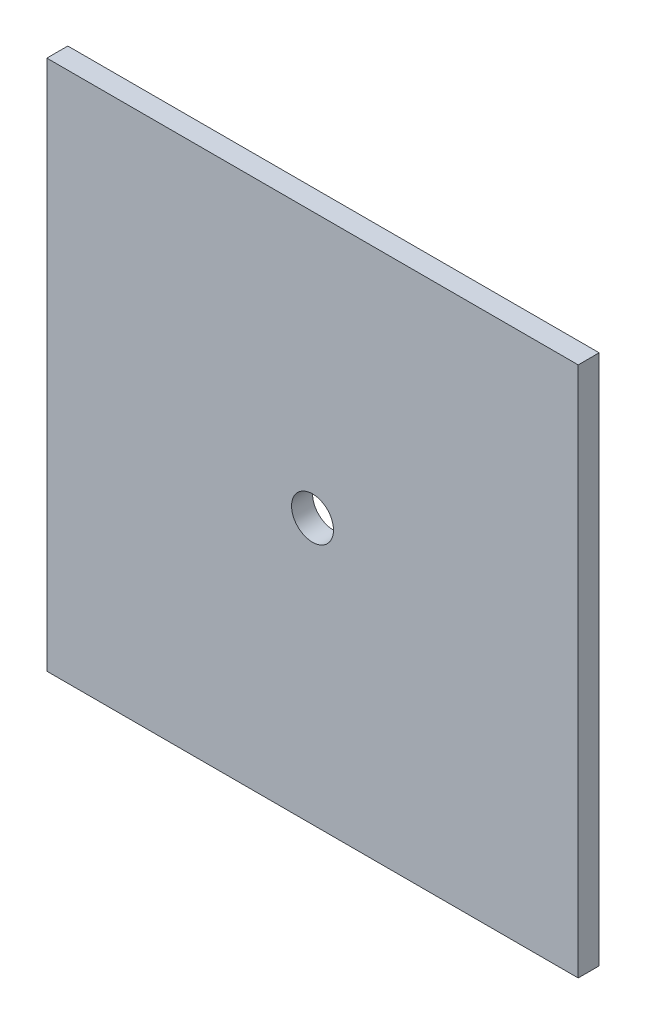
ISO-10303-21;
HEADER;
FILE_DESCRIPTION(('STEP AP214'),'2;1');
FILE_NAME('part.step','',(''),(''),'','','');
FILE_SCHEMA(('AUTOMOTIVE_DESIGN { 1 0 10303 214 1 1 1 1 }'));
ENDSEC;
DATA;
#1=APPLICATION_CONTEXT('core data for automotive mechanical design processes');
#2=APPLICATION_PROTOCOL_DEFINITION('international standard','automotive_design',2000,#1);
#3=PRODUCT_CONTEXT('',#1,'mechanical');
#4=PRODUCT('Part','Part','',(#3));
#5=PRODUCT_RELATED_PRODUCT_CATEGORY('part','',(#4));
#6=PRODUCT_DEFINITION_FORMATION('','',#4);
#7=PRODUCT_DEFINITION_CONTEXT('part definition',#1,'design');
#8=PRODUCT_DEFINITION('design','',#6,#7);
#9=PRODUCT_DEFINITION_SHAPE('','',#8);
#10=(LENGTH_UNIT() NAMED_UNIT(*) SI_UNIT(.MILLI.,.METRE.));
#11=(NAMED_UNIT(*) PLANE_ANGLE_UNIT() SI_UNIT($,.RADIAN.));
#12=(NAMED_UNIT(*) SI_UNIT($,.STERADIAN.) SOLID_ANGLE_UNIT());
#13=UNCERTAINTY_MEASURE_WITH_UNIT(LENGTH_MEASURE(1.E-05),#10,'distance_accuracy_value','');
#14=(GEOMETRIC_REPRESENTATION_CONTEXT(3) GLOBAL_UNCERTAINTY_ASSIGNED_CONTEXT((#13)) GLOBAL_UNIT_ASSIGNED_CONTEXT((#10,
#11,#12)) REPRESENTATION_CONTEXT('',''));
#15=CARTESIAN_POINT('',(0.,0.,0.));
#16=DIRECTION('',(0.,0.,1.));
#17=DIRECTION('',(1.,0.,0.));
#18=AXIS2_PLACEMENT_3D('',#15,#16,#17);
#19=CARTESIAN_POINT('',(-38.0270350861688,-38.,3.));
#20=DIRECTION('',(1.,0.,0.));
#21=DIRECTION('',(0.,0.,-1.));
#22=AXIS2_PLACEMENT_3D('',#19,#20,#21);
#23=PLANE('',#22);
#24=DIRECTION('',(0.,-1.,0.));
#25=VECTOR('',#24,1.);
#26=CARTESIAN_POINT('',(-38.0270350861688,-38.,0.));
#27=LINE('',#26,#25);
#28=CARTESIAN_POINT('',(-38.0270350861688,38.,0.));
#29=VERTEX_POINT('',#28);
#30=CARTESIAN_POINT('',(-38.0270350861688,-38.,0.));
#31=VERTEX_POINT('',#30);
#32=EDGE_CURVE('E107',#29,#31,#27,.T.);
#33=ORIENTED_EDGE('',*,*,#32,.T.);
#34=DIRECTION('',(0.,0.,-1.));
#35=VECTOR('',#34,1.);
#36=CARTESIAN_POINT('',(-38.0270350861688,-38.,3.));
#37=LINE('',#36,#35);
#38=CARTESIAN_POINT('',(-38.0270350861688,-38.,3.));
#39=VERTEX_POINT('',#38);
#40=EDGE_CURVE('E11',#39,#31,#37,.T.);
#41=ORIENTED_EDGE('',*,*,#40,.F.);
#42=DIRECTION('',(0.,-1.,0.));
#43=VECTOR('',#42,1.);
#44=CARTESIAN_POINT('',(-38.0270350861688,-38.,3.));
#45=LINE('',#44,#43);
#46=CARTESIAN_POINT('',(-38.0270350861688,38.,3.));
#47=VERTEX_POINT('',#46);
#48=EDGE_CURVE('E91',#47,#39,#45,.T.);
#49=ORIENTED_EDGE('',*,*,#48,.F.);
#50=DIRECTION('',(0.,0.,-1.));
#51=VECTOR('',#50,1.);
#52=CARTESIAN_POINT('',(-38.0270350861688,38.,3.));
#53=LINE('',#52,#51);
#54=EDGE_CURVE('E103',#47,#29,#53,.T.);
#55=ORIENTED_EDGE('',*,*,#54,.T.);
#56=EDGE_LOOP('',(#33,#41,#49,#55));
#57=FACE_BOUND('',#56,.T.);
#58=ADVANCED_FACE('F39',(#57),#23,.F.);
#59=CARTESIAN_POINT('',(38.0270350861688,-38.,3.));
#60=DIRECTION('',(0.,1.,0.));
#61=DIRECTION('',(-1.,0.,0.));
#62=AXIS2_PLACEMENT_3D('',#59,#60,#61);
#63=PLANE('',#62);
#64=DIRECTION('',(1.,0.,0.));
#65=VECTOR('',#64,1.);
#66=CARTESIAN_POINT('',(38.0270350861688,-38.,0.));
#67=LINE('',#66,#65);
#68=CARTESIAN_POINT('',(38.0270350861688,-38.,0.));
#69=VERTEX_POINT('',#68);
#70=EDGE_CURVE('E96',#31,#69,#67,.T.);
#71=ORIENTED_EDGE('',*,*,#70,.T.);
#72=DIRECTION('',(0.,0.,-1.));
#73=VECTOR('',#72,1.);
#74=CARTESIAN_POINT('',(38.0270350861688,-38.,3.));
#75=LINE('',#74,#73);
#76=CARTESIAN_POINT('',(38.0270350861688,-38.,3.));
#77=VERTEX_POINT('',#76);
#78=EDGE_CURVE('E48',#77,#69,#75,.T.);
#79=ORIENTED_EDGE('',*,*,#78,.F.);
#80=DIRECTION('',(1.,0.,0.));
#81=VECTOR('',#80,1.);
#82=CARTESIAN_POINT('',(38.0270350861688,-38.,3.));
#83=LINE('',#82,#81);
#84=EDGE_CURVE('E86',#39,#77,#83,.T.);
#85=ORIENTED_EDGE('',*,*,#84,.F.);
#86=ORIENTED_EDGE('',*,*,#40,.T.);
#87=EDGE_LOOP('',(#71,#79,#85,#86));
#88=FACE_BOUND('',#87,.T.);
#89=ADVANCED_FACE('F95',(#88),#63,.F.);
#90=CARTESIAN_POINT('',(38.0270350861688,-38.,3.));
#91=DIRECTION('',(-1.,0.,0.));
#92=DIRECTION('',(0.,0.,1.));
#93=AXIS2_PLACEMENT_3D('',#90,#91,#92);
#94=PLANE('',#93);
#95=DIRECTION('',(0.,1.,0.));
#96=VECTOR('',#95,1.);
#97=CARTESIAN_POINT('',(38.0270350861688,-38.,0.));
#98=LINE('',#97,#96);
#99=CARTESIAN_POINT('',(38.0270350861688,38.,0.));
#100=VERTEX_POINT('',#99);
#101=EDGE_CURVE('E73',#69,#100,#98,.T.);
#102=ORIENTED_EDGE('',*,*,#101,.T.);
#103=DIRECTION('',(0.,0.,-1.));
#104=VECTOR('',#103,1.);
#105=CARTESIAN_POINT('',(38.0270350861688,38.,3.));
#106=LINE('',#105,#104);
#107=CARTESIAN_POINT('',(38.0270350861688,38.,3.));
#108=VERTEX_POINT('',#107);
#109=EDGE_CURVE('E98',#108,#100,#106,.T.);
#110=ORIENTED_EDGE('',*,*,#109,.F.);
#111=DIRECTION('',(0.,1.,0.));
#112=VECTOR('',#111,1.);
#113=CARTESIAN_POINT('',(38.0270350861688,-38.,3.));
#114=LINE('',#113,#112);
#115=EDGE_CURVE('E89',#77,#108,#114,.T.);
#116=ORIENTED_EDGE('',*,*,#115,.F.);
#117=ORIENTED_EDGE('',*,*,#78,.T.);
#118=EDGE_LOOP('',(#102,#110,#116,#117));
#119=FACE_BOUND('',#118,.T.);
#120=ADVANCED_FACE('F99',(#119),#94,.F.);
#121=CARTESIAN_POINT('',(38.0270350861688,38.,3.));
#122=DIRECTION('',(0.,-1.,0.));
#123=DIRECTION('',(0.,0.,-1.));
#124=AXIS2_PLACEMENT_3D('',#121,#122,#123);
#125=PLANE('',#124);
#126=DIRECTION('',(-1.,0.,0.));
#127=VECTOR('',#126,1.);
#128=CARTESIAN_POINT('',(38.0270350861688,38.,0.));
#129=LINE('',#128,#127);
#130=EDGE_CURVE('E79',#100,#29,#129,.T.);
#131=ORIENTED_EDGE('',*,*,#130,.T.);
#132=ORIENTED_EDGE('',*,*,#54,.F.);
#133=DIRECTION('',(-1.,0.,0.));
#134=VECTOR('',#133,1.);
#135=CARTESIAN_POINT('',(38.0270350861688,38.,3.));
#136=LINE('',#135,#134);
#137=EDGE_CURVE('E56',#108,#47,#136,.T.);
#138=ORIENTED_EDGE('',*,*,#137,.F.);
#139=ORIENTED_EDGE('',*,*,#109,.T.);
#140=EDGE_LOOP('',(#131,#132,#138,#139));
#141=FACE_BOUND('',#140,.T.);
#142=ADVANCED_FACE('F121',(#141),#125,.F.);
#143=CARTESIAN_POINT('',(0.,0.,3.));
#144=DIRECTION('',(0.,0.,1.));
#145=DIRECTION('',(1.,0.,0.));
#146=AXIS2_PLACEMENT_3D('',#143,#144,#145);
#147=PLANE('',#146);
#148=CARTESIAN_POINT('',(0.,0.,3.));
#149=DIRECTION('',(0.,0.,1.));
#150=DIRECTION('',(1.,0.,0.));
#151=AXIS2_PLACEMENT_3D('',#148,#149,#150);
#152=CIRCLE('',#151,3.);
#153=CARTESIAN_POINT('',(3.,0.,3.));
#154=VERTEX_POINT('',#153);
#155=EDGE_CURVE('E128',#154,#154,#152,.T.);
#156=ORIENTED_EDGE('',*,*,#155,.F.);
#157=EDGE_LOOP('',(#156));
#158=FACE_BOUND('',#157,.T.);
#159=ORIENTED_EDGE('',*,*,#48,.T.);
#160=ORIENTED_EDGE('',*,*,#84,.T.);
#161=ORIENTED_EDGE('',*,*,#115,.T.);
#162=ORIENTED_EDGE('',*,*,#137,.T.);
#163=EDGE_LOOP('',(#159,#160,#161,#162));
#164=FACE_BOUND('',#163,.T.);
#165=ADVANCED_FACE('F87',(#158,#164),#147,.T.);
#166=CARTESIAN_POINT('',(0.,0.,0.));
#167=DIRECTION('',(0.,0.,1.));
#168=DIRECTION('',(1.,0.,0.));
#169=AXIS2_PLACEMENT_3D('',#166,#167,#168);
#170=PLANE('',#169);
#171=CARTESIAN_POINT('',(0.,0.,0.));
#172=DIRECTION('',(0.,0.,1.));
#173=DIRECTION('',(1.,0.,0.));
#174=AXIS2_PLACEMENT_3D('',#171,#172,#173);
#175=CIRCLE('',#174,3.);
#176=CARTESIAN_POINT('',(3.,0.,0.));
#177=VERTEX_POINT('',#176);
#178=EDGE_CURVE('E111',#177,#177,#175,.T.);
#179=ORIENTED_EDGE('',*,*,#178,.T.);
#180=EDGE_LOOP('',(#179));
#181=FACE_BOUND('',#180,.T.);
#182=ORIENTED_EDGE('',*,*,#32,.F.);
#183=ORIENTED_EDGE('',*,*,#130,.F.);
#184=ORIENTED_EDGE('',*,*,#101,.F.);
#185=ORIENTED_EDGE('',*,*,#70,.F.);
#186=EDGE_LOOP('',(#182,#183,#184,#185));
#187=FACE_BOUND('',#186,.T.);
#188=ADVANCED_FACE('F124',(#181,#187),#170,.F.);
#189=CARTESIAN_POINT('',(0.,0.,0.));
#190=DIRECTION('',(0.,0.,1.));
#191=DIRECTION('',(1.,0.,0.));
#192=AXIS2_PLACEMENT_3D('',#189,#190,#191);
#193=CYLINDRICAL_SURFACE('',#192,3.);
#194=ORIENTED_EDGE('',*,*,#178,.F.);
#195=EDGE_LOOP('',(#194));
#196=FACE_BOUND('',#195,.T.);
#197=ORIENTED_EDGE('',*,*,#155,.T.);
#198=EDGE_LOOP('',(#197));
#199=FACE_BOUND('',#198,.T.);
#200=ADVANCED_FACE('F137',(#196,#199),#193,.F.);
#201=CLOSED_SHELL('',(#58,#89,#120,#142,#165,#188,#200));
#202=MANIFOLD_SOLID_BREP('B2',#201);
#203=ADVANCED_BREP_SHAPE_REPRESENTATION('',(#18,#202),#14);
#204=SHAPE_DEFINITION_REPRESENTATION(#9,#203);
ENDSEC;
END-ISO-10303-21;
